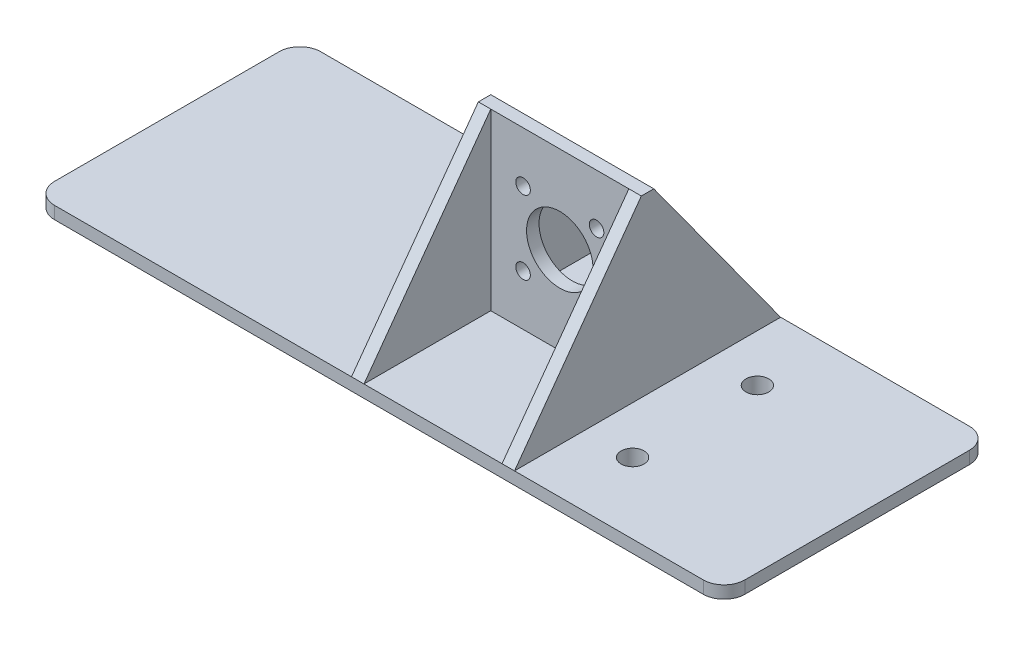
ISO-10303-21;
HEADER;
FILE_DESCRIPTION(('STEP AP214'),'2;1');
FILE_NAME('part.step','',(''),(''),'','','');
FILE_SCHEMA(('AUTOMOTIVE_DESIGN { 1 0 10303 214 1 1 1 1 }'));
ENDSEC;
DATA;
#1=APPLICATION_CONTEXT('core data for automotive mechanical design processes');
#2=APPLICATION_PROTOCOL_DEFINITION('international standard','automotive_design',2000,#1);
#3=PRODUCT_CONTEXT('',#1,'mechanical');
#4=PRODUCT('Part','Part','',(#3));
#5=PRODUCT_RELATED_PRODUCT_CATEGORY('part','',(#4));
#6=PRODUCT_DEFINITION_FORMATION('','',#4);
#7=PRODUCT_DEFINITION_CONTEXT('part definition',#1,'design');
#8=PRODUCT_DEFINITION('design','',#6,#7);
#9=PRODUCT_DEFINITION_SHAPE('','',#8);
#10=(LENGTH_UNIT() NAMED_UNIT(*) SI_UNIT(.MILLI.,.METRE.));
#11=(NAMED_UNIT(*) PLANE_ANGLE_UNIT() SI_UNIT($,.RADIAN.));
#12=(NAMED_UNIT(*) SI_UNIT($,.STERADIAN.) SOLID_ANGLE_UNIT());
#13=UNCERTAINTY_MEASURE_WITH_UNIT(LENGTH_MEASURE(1.E-05),#10,'distance_accuracy_value','');
#14=(GEOMETRIC_REPRESENTATION_CONTEXT(3) GLOBAL_UNCERTAINTY_ASSIGNED_CONTEXT((#13)) GLOBAL_UNIT_ASSIGNED_CONTEXT((#10,
#11,#12)) REPRESENTATION_CONTEXT('',''));
#15=CARTESIAN_POINT('',(0.,0.,0.));
#16=DIRECTION('',(0.,0.,1.));
#17=DIRECTION('',(1.,0.,0.));
#18=AXIS2_PLACEMENT_3D('',#15,#16,#17);
#19=CARTESIAN_POINT('',(78.,0.,-27.));
#20=DIRECTION('',(0.,-1.,0.));
#21=DIRECTION('',(0.,0.,-1.));
#22=AXIS2_PLACEMENT_3D('',#19,#20,#21);
#23=PLANE('',#22);
#24=CARTESIAN_POINT('',(44.,0.,-15.));
#25=DIRECTION('',(0.,-1.,0.));
#26=DIRECTION('',(0.,0.,-1.));
#27=AXIS2_PLACEMENT_3D('',#24,#25,#26);
#28=CIRCLE('',#27,4.75);
#29=CARTESIAN_POINT('',(44.,0.,-19.75));
#30=VERTEX_POINT('',#29);
#31=EDGE_CURVE('E734',#30,#30,#28,.T.);
#32=ORIENTED_EDGE('',*,*,#31,.F.);
#33=EDGE_LOOP('',(#32));
#34=FACE_BOUND('',#33,.T.);
#35=CARTESIAN_POINT('',(78.,0.,-27.));
#36=DIRECTION('',(0.,1.,0.));
#37=DIRECTION('',(0.,0.,-1.));
#38=AXIS2_PLACEMENT_3D('',#35,#36,#37);
#39=CIRCLE('',#38,5.);
#40=CARTESIAN_POINT('',(83.,0.,-27.));
#41=VERTEX_POINT('',#40);
#42=CARTESIAN_POINT('',(78.,0.,-32.));
#43=VERTEX_POINT('',#42);
#44=EDGE_CURVE('E226',#41,#43,#39,.T.);
#45=ORIENTED_EDGE('',*,*,#44,.F.);
#46=DIRECTION('',(0.,0.,-1.));
#47=VECTOR('',#46,1.);
#48=CARTESIAN_POINT('',(83.,0.,-27.));
#49=LINE('',#48,#47);
#50=CARTESIAN_POINT('',(83.,0.,27.));
#51=VERTEX_POINT('',#50);
#52=EDGE_CURVE('E205',#51,#41,#49,.T.);
#53=ORIENTED_EDGE('',*,*,#52,.F.);
#54=CARTESIAN_POINT('',(78.,0.,27.));
#55=DIRECTION('',(0.,1.,0.));
#56=DIRECTION('',(0.,0.,-1.));
#57=AXIS2_PLACEMENT_3D('',#54,#55,#56);
#58=CIRCLE('',#57,5.);
#59=CARTESIAN_POINT('',(78.,0.,32.));
#60=VERTEX_POINT('',#59);
#61=EDGE_CURVE('E240',#60,#51,#58,.T.);
#62=ORIENTED_EDGE('',*,*,#61,.F.);
#63=DIRECTION('',(1.,0.,0.));
#64=VECTOR('',#63,1.);
#65=CARTESIAN_POINT('',(78.,0.,32.));
#66=LINE('',#65,#64);
#67=CARTESIAN_POINT('',(-78.,0.,32.));
#68=VERTEX_POINT('',#67);
#69=EDGE_CURVE('E238',#68,#60,#66,.T.);
#70=ORIENTED_EDGE('',*,*,#69,.F.);
#71=CARTESIAN_POINT('',(-78.,0.,27.));
#72=DIRECTION('',(0.,1.,0.));
#73=DIRECTION('',(0.,0.,-1.));
#74=AXIS2_PLACEMENT_3D('',#71,#72,#73);
#75=CIRCLE('',#74,5.);
#76=CARTESIAN_POINT('',(-83.,0.,27.));
#77=VERTEX_POINT('',#76);
#78=EDGE_CURVE('E236',#77,#68,#75,.T.);
#79=ORIENTED_EDGE('',*,*,#78,.F.);
#80=DIRECTION('',(0.,0.,1.));
#81=VECTOR('',#80,1.);
#82=CARTESIAN_POINT('',(-83.,0.,-27.));
#83=LINE('',#82,#81);
#84=CARTESIAN_POINT('',(-83.,0.,-27.));
#85=VERTEX_POINT('',#84);
#86=EDGE_CURVE('E234',#85,#77,#83,.T.);
#87=ORIENTED_EDGE('',*,*,#86,.F.);
#88=CARTESIAN_POINT('',(-78.,0.,-27.));
#89=DIRECTION('',(0.,1.,0.));
#90=DIRECTION('',(0.,0.,1.));
#91=AXIS2_PLACEMENT_3D('',#88,#89,#90);
#92=CIRCLE('',#91,5.);
#93=CARTESIAN_POINT('',(-78.,0.,-32.));
#94=VERTEX_POINT('',#93);
#95=EDGE_CURVE('E232',#94,#85,#92,.T.);
#96=ORIENTED_EDGE('',*,*,#95,.F.);
#97=DIRECTION('',(-1.,0.,0.));
#98=VECTOR('',#97,1.);
#99=CARTESIAN_POINT('',(78.,0.,-32.));
#100=LINE('',#99,#98);
#101=EDGE_CURVE('E229',#43,#94,#100,.T.);
#102=ORIENTED_EDGE('',*,*,#101,.F.);
#103=EDGE_LOOP('',(#45,#53,#62,#70,#79,#87,#96,#102));
#104=FACE_BOUND('',#103,.T.);
#105=CARTESIAN_POINT('',(-18.,0.,0.));
#106=DIRECTION('',(0.,-1.,0.));
#107=DIRECTION('',(0.,0.,-1.));
#108=AXIS2_PLACEMENT_3D('',#105,#106,#107);
#109=CIRCLE('',#108,4.75);
#110=CARTESIAN_POINT('',(-18.,0.,-4.75));
#111=VERTEX_POINT('',#110);
#112=EDGE_CURVE('E723',#111,#111,#109,.T.);
#113=ORIENTED_EDGE('',*,*,#112,.F.);
#114=EDGE_LOOP('',(#113));
#115=FACE_BOUND('',#114,.T.);
#116=CARTESIAN_POINT('',(44.,0.,15.));
#117=DIRECTION('',(0.,-1.,0.));
#118=DIRECTION('',(0.,0.,-1.));
#119=AXIS2_PLACEMENT_3D('',#116,#117,#118);
#120=CIRCLE('',#119,4.75);
#121=CARTESIAN_POINT('',(44.,0.,10.25));
#122=VERTEX_POINT('',#121);
#123=EDGE_CURVE('E743',#122,#122,#120,.T.);
#124=ORIENTED_EDGE('',*,*,#123,.F.);
#125=EDGE_LOOP('',(#124));
#126=FACE_BOUND('',#125,.T.);
#127=ADVANCED_FACE('F37',(#34,#104,#115,#126),#23,.T.);
#128=CARTESIAN_POINT('',(78.,3.,-27.));
#129=DIRECTION('',(0.,-1.,0.));
#130=DIRECTION('',(0.,0.,-1.));
#131=AXIS2_PLACEMENT_3D('',#128,#129,#130);
#132=PLANE('',#131);
#133=CARTESIAN_POINT('',(-18.,3.,0.));
#134=DIRECTION('',(0.,1.,0.));
#135=DIRECTION('',(0.,0.,1.));
#136=AXIS2_PLACEMENT_3D('',#133,#134,#135);
#137=CIRCLE('',#136,2.75);
#138=CARTESIAN_POINT('',(-18.,3.,2.75));
#139=VERTEX_POINT('',#138);
#140=EDGE_CURVE('E302',#139,#139,#137,.T.);
#141=ORIENTED_EDGE('',*,*,#140,.F.);
#142=EDGE_LOOP('',(#141));
#143=FACE_BOUND('',#142,.T.);
#144=DIRECTION('',(1.,0.,0.));
#145=VECTOR('',#144,1.);
#146=CARTESIAN_POINT('',(78.,3.,32.));
#147=LINE('',#146,#145);
#148=CARTESIAN_POINT('',(-78.,3.,32.));
#149=VERTEX_POINT('',#148);
#150=CARTESIAN_POINT('',(-6.59999999999999,3.,32.));
#151=VERTEX_POINT('',#150);
#152=EDGE_CURVE('E191',#149,#151,#147,.T.);
#153=ORIENTED_EDGE('',*,*,#152,.T.);
#154=DIRECTION('',(0.,0.,1.));
#155=VECTOR('',#154,1.);
#156=CARTESIAN_POINT('',(-6.59999999999999,3.,-1.49999999999999));
#157=LINE('',#156,#155);
#158=CARTESIAN_POINT('',(-6.59999999999999,3.,-32.));
#159=VERTEX_POINT('',#158);
#160=EDGE_CURVE('E180',#159,#151,#157,.T.);
#161=ORIENTED_EDGE('',*,*,#160,.F.);
#162=DIRECTION('',(-1.,0.,0.));
#163=VECTOR('',#162,1.);
#164=CARTESIAN_POINT('',(78.,3.,-32.));
#165=LINE('',#164,#163);
#166=CARTESIAN_POINT('',(-78.,3.,-32.));
#167=VERTEX_POINT('',#166);
#168=EDGE_CURVE('E188',#159,#167,#165,.T.);
#169=ORIENTED_EDGE('',*,*,#168,.T.);
#170=CARTESIAN_POINT('',(-78.,3.,-27.));
#171=DIRECTION('',(0.,1.,0.));
#172=DIRECTION('',(0.,0.,1.));
#173=AXIS2_PLACEMENT_3D('',#170,#171,#172);
#174=CIRCLE('',#173,5.);
#175=CARTESIAN_POINT('',(-83.,3.,-27.));
#176=VERTEX_POINT('',#175);
#177=EDGE_CURVE('E209',#167,#176,#174,.T.);
#178=ORIENTED_EDGE('',*,*,#177,.T.);
#179=DIRECTION('',(0.,0.,1.));
#180=VECTOR('',#179,1.);
#181=CARTESIAN_POINT('',(-83.,3.,-27.));
#182=LINE('',#181,#180);
#183=CARTESIAN_POINT('',(-83.,3.,27.));
#184=VERTEX_POINT('',#183);
#185=EDGE_CURVE('E212',#176,#184,#182,.T.);
#186=ORIENTED_EDGE('',*,*,#185,.T.);
#187=CARTESIAN_POINT('',(-78.,3.,27.));
#188=DIRECTION('',(0.,1.,0.));
#189=DIRECTION('',(0.,0.,-1.));
#190=AXIS2_PLACEMENT_3D('',#187,#188,#189);
#191=CIRCLE('',#190,5.);
#192=EDGE_CURVE('E214',#184,#149,#191,.T.);
#193=ORIENTED_EDGE('',*,*,#192,.T.);
#194=EDGE_LOOP('',(#153,#161,#169,#178,#186,#193));
#195=FACE_BOUND('',#194,.T.);
#196=ADVANCED_FACE('F187',(#143,#195),#132,.F.);
#197=CARTESIAN_POINT('',(29.6,3.,-32.));
#198=VERTEX_POINT('',#197);
#199=CARTESIAN_POINT('',(-3.59999999999999,3.,-32.));
#200=VERTEX_POINT('',#199);
#201=EDGE_CURVE('E199',#198,#200,#165,.T.);
#202=ORIENTED_EDGE('',*,*,#201,.T.);
#203=DIRECTION('',(0.,0.,-1.));
#204=VECTOR('',#203,1.);
#205=CARTESIAN_POINT('',(-3.59999999999999,3.,32.));
#206=LINE('',#205,#204);
#207=CARTESIAN_POINT('',(-3.59999999999999,3.,-1.49999999999999));
#208=VERTEX_POINT('',#207);
#209=EDGE_CURVE('E704',#208,#200,#206,.T.);
#210=ORIENTED_EDGE('',*,*,#209,.F.);
#211=DIRECTION('',(-1.,0.,0.));
#212=VECTOR('',#211,1.);
#213=CARTESIAN_POINT('',(-6.59999999999999,3.,-1.49999999999999));
#214=LINE('',#213,#212);
#215=CARTESIAN_POINT('',(29.6,3.,-1.50000000000001));
#216=VERTEX_POINT('',#215);
#217=EDGE_CURVE('E297',#216,#208,#214,.T.);
#218=ORIENTED_EDGE('',*,*,#217,.F.);
#219=DIRECTION('',(0.,0.,-1.));
#220=VECTOR('',#219,1.);
#221=CARTESIAN_POINT('',(29.6,3.,32.));
#222=LINE('',#221,#220);
#223=EDGE_CURVE('E52',#216,#198,#222,.T.);
#224=ORIENTED_EDGE('',*,*,#223,.T.);
#225=EDGE_LOOP('',(#202,#210,#218,#224));
#226=FACE_BOUND('',#225,.T.);
#227=ADVANCED_FACE('F322',(#226),#132,.F.);
#228=CARTESIAN_POINT('',(44.,3.,15.));
#229=DIRECTION('',(0.,1.,0.));
#230=DIRECTION('',(0.,0.,1.));
#231=AXIS2_PLACEMENT_3D('',#228,#229,#230);
#232=CIRCLE('',#231,2.75);
#233=CARTESIAN_POINT('',(44.,3.,17.75));
#234=VERTEX_POINT('',#233);
#235=EDGE_CURVE('E230',#234,#234,#232,.T.);
#236=ORIENTED_EDGE('',*,*,#235,.F.);
#237=EDGE_LOOP('',(#236));
#238=FACE_BOUND('',#237,.T.);
#239=CARTESIAN_POINT('',(44.,3.,-15.));
#240=DIRECTION('',(0.,1.,0.));
#241=DIRECTION('',(0.,0.,-1.));
#242=AXIS2_PLACEMENT_3D('',#239,#240,#241);
#243=CIRCLE('',#242,2.75);
#244=CARTESIAN_POINT('',(44.,3.,-17.75));
#245=VERTEX_POINT('',#244);
#246=EDGE_CURVE('E312',#245,#245,#243,.T.);
#247=ORIENTED_EDGE('',*,*,#246,.F.);
#248=EDGE_LOOP('',(#247));
#249=FACE_BOUND('',#248,.T.);
#250=CARTESIAN_POINT('',(78.,3.,-32.));
#251=VERTEX_POINT('',#250);
#252=CARTESIAN_POINT('',(32.6,3.,-32.));
#253=VERTEX_POINT('',#252);
#254=EDGE_CURVE('E202',#251,#253,#165,.T.);
#255=ORIENTED_EDGE('',*,*,#254,.T.);
#256=DIRECTION('',(0.,0.,-1.));
#257=VECTOR('',#256,1.);
#258=CARTESIAN_POINT('',(32.6,3.,-1.50000000000001));
#259=LINE('',#258,#257);
#260=CARTESIAN_POINT('',(32.6,3.,32.));
#261=VERTEX_POINT('',#260);
#262=EDGE_CURVE('E305',#261,#253,#259,.T.);
#263=ORIENTED_EDGE('',*,*,#262,.F.);
#264=CARTESIAN_POINT('',(78.,3.,32.));
#265=VERTEX_POINT('',#264);
#266=EDGE_CURVE('E218',#261,#265,#147,.T.);
#267=ORIENTED_EDGE('',*,*,#266,.T.);
#268=CARTESIAN_POINT('',(78.,3.,27.));
#269=DIRECTION('',(0.,1.,0.));
#270=DIRECTION('',(0.,0.,-1.));
#271=AXIS2_PLACEMENT_3D('',#268,#269,#270);
#272=CIRCLE('',#271,5.);
#273=CARTESIAN_POINT('',(83.,3.,27.));
#274=VERTEX_POINT('',#273);
#275=EDGE_CURVE('E220',#265,#274,#272,.T.);
#276=ORIENTED_EDGE('',*,*,#275,.T.);
#277=DIRECTION('',(0.,0.,-1.));
#278=VECTOR('',#277,1.);
#279=CARTESIAN_POINT('',(83.,3.,-27.));
#280=LINE('',#279,#278);
#281=CARTESIAN_POINT('',(83.,3.,-27.));
#282=VERTEX_POINT('',#281);
#283=EDGE_CURVE('E223',#274,#282,#280,.T.);
#284=ORIENTED_EDGE('',*,*,#283,.T.);
#285=CARTESIAN_POINT('',(78.,3.,-27.));
#286=DIRECTION('',(0.,1.,0.));
#287=DIRECTION('',(0.,0.,-1.));
#288=AXIS2_PLACEMENT_3D('',#285,#286,#287);
#289=CIRCLE('',#288,5.);
#290=EDGE_CURVE('E200',#282,#251,#289,.T.);
#291=ORIENTED_EDGE('',*,*,#290,.T.);
#292=EDGE_LOOP('',(#255,#263,#267,#276,#284,#291));
#293=FACE_BOUND('',#292,.T.);
#294=ADVANCED_FACE('F329',(#238,#249,#293),#132,.F.);
#295=DIRECTION('',(1.,0.,0.));
#296=VECTOR('',#295,1.);
#297=CARTESIAN_POINT('',(-6.59999999999999,3.,1.49999999999999));
#298=LINE('',#297,#296);
#299=CARTESIAN_POINT('',(-3.59999999999999,3.,1.49999999999999));
#300=VERTEX_POINT('',#299);
#301=CARTESIAN_POINT('',(29.6,3.,1.49999999999999));
#302=VERTEX_POINT('',#301);
#303=EDGE_CURVE('E192',#300,#302,#298,.T.);
#304=ORIENTED_EDGE('',*,*,#303,.F.);
#305=CARTESIAN_POINT('',(-3.59999999999999,3.,32.));
#306=VERTEX_POINT('',#305);
#307=EDGE_CURVE('E284',#306,#300,#206,.T.);
#308=ORIENTED_EDGE('',*,*,#307,.F.);
#309=CARTESIAN_POINT('',(29.6,3.,32.));
#310=VERTEX_POINT('',#309);
#311=EDGE_CURVE('E221',#306,#310,#147,.T.);
#312=ORIENTED_EDGE('',*,*,#311,.T.);
#313=EDGE_CURVE('E348',#310,#302,#222,.T.);
#314=ORIENTED_EDGE('',*,*,#313,.T.);
#315=EDGE_LOOP('',(#304,#308,#312,#314));
#316=FACE_BOUND('',#315,.T.);
#317=ADVANCED_FACE('F324',(#316),#132,.F.);
#318=CARTESIAN_POINT('',(78.,3.,-27.));
#319=DIRECTION('',(0.,-1.,0.));
#320=DIRECTION('',(0.,0.,-1.));
#321=AXIS2_PLACEMENT_3D('',#318,#319,#320);
#322=CYLINDRICAL_SURFACE('',#321,5.);
#323=ORIENTED_EDGE('',*,*,#44,.T.);
#324=DIRECTION('',(0.,-1.,0.));
#325=VECTOR('',#324,1.);
#326=CARTESIAN_POINT('',(78.,3.,-32.));
#327=LINE('',#326,#325);
#328=EDGE_CURVE('E261',#251,#43,#327,.T.);
#329=ORIENTED_EDGE('',*,*,#328,.F.);
#330=ORIENTED_EDGE('',*,*,#290,.F.);
#331=DIRECTION('',(0.,-1.,0.));
#332=VECTOR('',#331,1.);
#333=CARTESIAN_POINT('',(83.,3.,-27.));
#334=LINE('',#333,#332);
#335=EDGE_CURVE('E225',#282,#41,#334,.T.);
#336=ORIENTED_EDGE('',*,*,#335,.T.);
#337=EDGE_LOOP('',(#323,#329,#330,#336));
#338=FACE_BOUND('',#337,.T.);
#339=ADVANCED_FACE('F39',(#338),#322,.T.);
#340=CARTESIAN_POINT('',(78.,3.,-32.));
#341=DIRECTION('',(0.,0.,1.));
#342=DIRECTION('',(1.,0.,0.));
#343=AXIS2_PLACEMENT_3D('',#340,#341,#342);
#344=PLANE('',#343);
#345=ORIENTED_EDGE('',*,*,#168,.F.);
#346=DIRECTION('',(-1.,0.,0.));
#347=VECTOR('',#346,1.);
#348=CARTESIAN_POINT('',(83.,3.,-32.));
#349=LINE('',#348,#347);
#350=EDGE_CURVE('E162',#200,#159,#349,.T.);
#351=ORIENTED_EDGE('',*,*,#350,.F.);
#352=ORIENTED_EDGE('',*,*,#201,.F.);
#353=EDGE_CURVE('E172',#253,#198,#349,.T.);
#354=ORIENTED_EDGE('',*,*,#353,.F.);
#355=ORIENTED_EDGE('',*,*,#254,.F.);
#356=ORIENTED_EDGE('',*,*,#328,.T.);
#357=ORIENTED_EDGE('',*,*,#101,.T.);
#358=DIRECTION('',(0.,-1.,0.));
#359=VECTOR('',#358,1.);
#360=CARTESIAN_POINT('',(-78.,3.,-32.));
#361=LINE('',#360,#359);
#362=EDGE_CURVE('E197',#167,#94,#361,.T.);
#363=ORIENTED_EDGE('',*,*,#362,.F.);
#364=EDGE_LOOP('',(#345,#351,#352,#354,#355,#356,#357,#363));
#365=FACE_BOUND('',#364,.T.);
#366=ADVANCED_FACE('F195',(#365),#344,.F.);
#367=CARTESIAN_POINT('',(-78.,3.,-27.));
#368=DIRECTION('',(0.,-1.,0.));
#369=DIRECTION('',(0.,0.,-1.));
#370=AXIS2_PLACEMENT_3D('',#367,#368,#369);
#371=CYLINDRICAL_SURFACE('',#370,5.);
#372=ORIENTED_EDGE('',*,*,#95,.T.);
#373=DIRECTION('',(0.,-1.,0.));
#374=VECTOR('',#373,1.);
#375=CARTESIAN_POINT('',(-83.,3.,-27.));
#376=LINE('',#375,#374);
#377=EDGE_CURVE('E257',#176,#85,#376,.T.);
#378=ORIENTED_EDGE('',*,*,#377,.F.);
#379=ORIENTED_EDGE('',*,*,#177,.F.);
#380=ORIENTED_EDGE('',*,*,#362,.T.);
#381=EDGE_LOOP('',(#372,#378,#379,#380));
#382=FACE_BOUND('',#381,.T.);
#383=ADVANCED_FACE('F455',(#382),#371,.T.);
#384=CARTESIAN_POINT('',(-83.,3.,-27.));
#385=DIRECTION('',(1.,0.,0.));
#386=DIRECTION('',(0.,0.,-1.));
#387=AXIS2_PLACEMENT_3D('',#384,#385,#386);
#388=PLANE('',#387);
#389=ORIENTED_EDGE('',*,*,#86,.T.);
#390=DIRECTION('',(0.,-1.,0.));
#391=VECTOR('',#390,1.);
#392=CARTESIAN_POINT('',(-83.,3.,27.));
#393=LINE('',#392,#391);
#394=EDGE_CURVE('E254',#184,#77,#393,.T.);
#395=ORIENTED_EDGE('',*,*,#394,.F.);
#396=ORIENTED_EDGE('',*,*,#185,.F.);
#397=ORIENTED_EDGE('',*,*,#377,.T.);
#398=EDGE_LOOP('',(#389,#395,#396,#397));
#399=FACE_BOUND('',#398,.T.);
#400=ADVANCED_FACE('F451',(#399),#388,.F.);
#401=CARTESIAN_POINT('',(-78.,3.,27.));
#402=DIRECTION('',(0.,-1.,0.));
#403=DIRECTION('',(0.,0.,-1.));
#404=AXIS2_PLACEMENT_3D('',#401,#402,#403);
#405=CYLINDRICAL_SURFACE('',#404,5.);
#406=ORIENTED_EDGE('',*,*,#78,.T.);
#407=DIRECTION('',(0.,-1.,0.));
#408=VECTOR('',#407,1.);
#409=CARTESIAN_POINT('',(-78.,3.,32.));
#410=LINE('',#409,#408);
#411=EDGE_CURVE('E251',#149,#68,#410,.T.);
#412=ORIENTED_EDGE('',*,*,#411,.F.);
#413=ORIENTED_EDGE('',*,*,#192,.F.);
#414=ORIENTED_EDGE('',*,*,#394,.T.);
#415=EDGE_LOOP('',(#406,#412,#413,#414));
#416=FACE_BOUND('',#415,.T.);
#417=ADVANCED_FACE('F447',(#416),#405,.T.);
#418=CARTESIAN_POINT('',(78.,3.,32.));
#419=DIRECTION('',(0.,0.,-1.));
#420=DIRECTION('',(-1.,0.,0.));
#421=AXIS2_PLACEMENT_3D('',#418,#419,#420);
#422=PLANE('',#421);
#423=ORIENTED_EDGE('',*,*,#266,.F.);
#424=DIRECTION('',(-1.,0.,0.));
#425=VECTOR('',#424,1.);
#426=CARTESIAN_POINT('',(83.,3.,32.));
#427=LINE('',#426,#425);
#428=EDGE_CURVE('E279',#261,#310,#427,.T.);
#429=ORIENTED_EDGE('',*,*,#428,.T.);
#430=ORIENTED_EDGE('',*,*,#311,.F.);
#431=EDGE_CURVE('E269',#306,#151,#427,.T.);
#432=ORIENTED_EDGE('',*,*,#431,.T.);
#433=ORIENTED_EDGE('',*,*,#152,.F.);
#434=ORIENTED_EDGE('',*,*,#411,.T.);
#435=ORIENTED_EDGE('',*,*,#69,.T.);
#436=DIRECTION('',(0.,-1.,0.));
#437=VECTOR('',#436,1.);
#438=CARTESIAN_POINT('',(78.,3.,32.));
#439=LINE('',#438,#437);
#440=EDGE_CURVE('E248',#265,#60,#439,.T.);
#441=ORIENTED_EDGE('',*,*,#440,.F.);
#442=EDGE_LOOP('',(#423,#429,#430,#432,#433,#434,#435,#441));
#443=FACE_BOUND('',#442,.T.);
#444=ADVANCED_FACE('F442',(#443),#422,.F.);
#445=CARTESIAN_POINT('',(78.,3.,27.));
#446=DIRECTION('',(0.,-1.,0.));
#447=DIRECTION('',(0.,0.,-1.));
#448=AXIS2_PLACEMENT_3D('',#445,#446,#447);
#449=CYLINDRICAL_SURFACE('',#448,5.);
#450=ORIENTED_EDGE('',*,*,#61,.T.);
#451=DIRECTION('',(0.,-1.,0.));
#452=VECTOR('',#451,1.);
#453=CARTESIAN_POINT('',(83.,3.,27.));
#454=LINE('',#453,#452);
#455=EDGE_CURVE('E245',#274,#51,#454,.T.);
#456=ORIENTED_EDGE('',*,*,#455,.F.);
#457=ORIENTED_EDGE('',*,*,#275,.F.);
#458=ORIENTED_EDGE('',*,*,#440,.T.);
#459=EDGE_LOOP('',(#450,#456,#457,#458));
#460=FACE_BOUND('',#459,.T.);
#461=ADVANCED_FACE('F435',(#460),#449,.T.);
#462=CARTESIAN_POINT('',(83.,3.,-27.));
#463=DIRECTION('',(-1.,0.,0.));
#464=DIRECTION('',(0.,0.,1.));
#465=AXIS2_PLACEMENT_3D('',#462,#463,#464);
#466=PLANE('',#465);
#467=ORIENTED_EDGE('',*,*,#52,.T.);
#468=ORIENTED_EDGE('',*,*,#335,.F.);
#469=ORIENTED_EDGE('',*,*,#283,.F.);
#470=ORIENTED_EDGE('',*,*,#455,.T.);
#471=EDGE_LOOP('',(#467,#468,#469,#470));
#472=FACE_BOUND('',#471,.T.);
#473=ADVANCED_FACE('F430',(#472),#466,.F.);
#474=CARTESIAN_POINT('',(-18.,0.,0.));
#475=DIRECTION('',(0.,1.,0.));
#476=DIRECTION('',(0.,0.,1.));
#477=AXIS2_PLACEMENT_3D('',#474,#475,#476);
#478=CYLINDRICAL_SURFACE('',#477,2.75);
#479=ORIENTED_EDGE('',*,*,#140,.T.);
#480=EDGE_LOOP('',(#479));
#481=FACE_BOUND('',#480,.T.);
#482=CARTESIAN_POINT('',(-18.,-4.5,0.));
#483=DIRECTION('',(0.,-1.,0.));
#484=DIRECTION('',(0.,0.,-1.));
#485=AXIS2_PLACEMENT_3D('',#482,#483,#484);
#486=CIRCLE('',#485,2.75);
#487=CARTESIAN_POINT('',(-18.,-4.5,-2.75));
#488=VERTEX_POINT('',#487);
#489=EDGE_CURVE('E726',#488,#488,#486,.T.);
#490=ORIENTED_EDGE('',*,*,#489,.T.);
#491=EDGE_LOOP('',(#490));
#492=FACE_BOUND('',#491,.T.);
#493=ADVANCED_FACE('F318',(#481,#492),#478,.F.);
#494=CARTESIAN_POINT('',(44.,0.,-15.));
#495=DIRECTION('',(0.,1.,0.));
#496=DIRECTION('',(0.,0.,1.));
#497=AXIS2_PLACEMENT_3D('',#494,#495,#496);
#498=CYLINDRICAL_SURFACE('',#497,2.75);
#499=ORIENTED_EDGE('',*,*,#246,.T.);
#500=EDGE_LOOP('',(#499));
#501=FACE_BOUND('',#500,.T.);
#502=CARTESIAN_POINT('',(44.,-4.5,-15.));
#503=DIRECTION('',(0.,-1.,0.));
#504=DIRECTION('',(0.,0.,-1.));
#505=AXIS2_PLACEMENT_3D('',#502,#503,#504);
#506=CIRCLE('',#505,2.75);
#507=CARTESIAN_POINT('',(44.,-4.5,-17.75));
#508=VERTEX_POINT('',#507);
#509=EDGE_CURVE('E731',#508,#508,#506,.T.);
#510=ORIENTED_EDGE('',*,*,#509,.T.);
#511=EDGE_LOOP('',(#510));
#512=FACE_BOUND('',#511,.T.);
#513=ADVANCED_FACE('F425',(#501,#512),#498,.F.);
#514=CARTESIAN_POINT('',(44.,0.,15.));
#515=DIRECTION('',(0.,1.,0.));
#516=DIRECTION('',(0.,0.,1.));
#517=AXIS2_PLACEMENT_3D('',#514,#515,#516);
#518=CYLINDRICAL_SURFACE('',#517,2.75);
#519=ORIENTED_EDGE('',*,*,#235,.T.);
#520=EDGE_LOOP('',(#519));
#521=FACE_BOUND('',#520,.T.);
#522=CARTESIAN_POINT('',(44.,-4.5,15.));
#523=DIRECTION('',(0.,-1.,0.));
#524=DIRECTION('',(0.,0.,-1.));
#525=AXIS2_PLACEMENT_3D('',#522,#523,#524);
#526=CIRCLE('',#525,2.75);
#527=CARTESIAN_POINT('',(44.,-4.5,12.25));
#528=VERTEX_POINT('',#527);
#529=EDGE_CURVE('E738',#528,#528,#526,.T.);
#530=ORIENTED_EDGE('',*,*,#529,.T.);
#531=EDGE_LOOP('',(#530));
#532=FACE_BOUND('',#531,.T.);
#533=ADVANCED_FACE('F422',(#521,#532),#518,.F.);
#534=CARTESIAN_POINT('',(-6.59999999999999,45.,-1.49999999999999));
#535=DIRECTION('',(1.,0.,0.));
#536=DIRECTION('',(0.,0.,-1.));
#537=AXIS2_PLACEMENT_3D('',#534,#535,#536);
#538=PLANE('',#537);
#539=DIRECTION('',(0.,0.,1.));
#540=VECTOR('',#539,1.);
#541=CARTESIAN_POINT('',(-6.59999999999999,45.,-1.49999999999999));
#542=LINE('',#541,#540);
#543=CARTESIAN_POINT('',(-6.59999999999999,45.,-1.5));
#544=VERTEX_POINT('',#543);
#545=CARTESIAN_POINT('',(-6.59999999999999,45.,1.5));
#546=VERTEX_POINT('',#545);
#547=EDGE_CURVE('E183',#544,#546,#542,.T.);
#548=ORIENTED_EDGE('',*,*,#547,.F.);
#549=DIRECTION('',(0.,0.809152433574184,0.587598791047919));
#550=VECTOR('',#549,1.);
#551=CARTESIAN_POINT('',(-6.59999999999999,45.,-1.5));
#552=LINE('',#551,#550);
#553=EDGE_CURVE('E165',#159,#544,#552,.T.);
#554=ORIENTED_EDGE('',*,*,#553,.F.);
#555=ORIENTED_EDGE('',*,*,#160,.T.);
#556=DIRECTION('',(0.,-0.809152433574184,0.587598791047919));
#557=VECTOR('',#556,1.);
#558=CARTESIAN_POINT('',(-6.59999999999999,45.,1.5));
#559=LINE('',#558,#557);
#560=EDGE_CURVE('E184',#546,#151,#559,.T.);
#561=ORIENTED_EDGE('',*,*,#560,.F.);
#562=EDGE_LOOP('',(#548,#554,#555,#561));
#563=FACE_BOUND('',#562,.T.);
#564=ADVANCED_FACE('F178',(#563),#538,.F.);
#565=CARTESIAN_POINT('',(-6.59999999999999,45.,1.49999999999999));
#566=DIRECTION('',(0.,0.,-1.));
#567=DIRECTION('',(-1.,0.,0.));
#568=AXIS2_PLACEMENT_3D('',#565,#566,#567);
#569=PLANE('',#568);
#570=CARTESIAN_POINT('',(4.16116523516813,32.8388347648318,1.49999999999999));
#571=DIRECTION('',(0.,0.,-1.));
#572=DIRECTION('',(-1.,0.,0.));
#573=AXIS2_PLACEMENT_3D('',#570,#571,#572);
#574=CIRCLE('',#573,1.75);
#575=CARTESIAN_POINT('',(2.41116523516813,32.8388347648318,1.49999999999999));
#576=VERTEX_POINT('',#575);
#577=EDGE_CURVE('E193',#576,#576,#574,.T.);
#578=ORIENTED_EDGE('',*,*,#577,.T.);
#579=EDGE_LOOP('',(#578));
#580=FACE_BOUND('',#579,.T.);
#581=CARTESIAN_POINT('',(21.8388347648319,32.8388347648318,1.49999999999999));
#582=DIRECTION('',(0.,0.,-1.));
#583=DIRECTION('',(-1.,0.,0.));
#584=AXIS2_PLACEMENT_3D('',#581,#582,#583);
#585=CIRCLE('',#584,1.75);
#586=CARTESIAN_POINT('',(20.0888347648319,32.8388347648318,1.49999999999999));
#587=VERTEX_POINT('',#586);
#588=EDGE_CURVE('E381',#587,#587,#585,.T.);
#589=ORIENTED_EDGE('',*,*,#588,.T.);
#590=EDGE_LOOP('',(#589));
#591=FACE_BOUND('',#590,.T.);
#592=CARTESIAN_POINT('',(4.16116523516813,15.1611652351682,1.49999999999999));
#593=DIRECTION('',(0.,0.,-1.));
#594=DIRECTION('',(-1.,0.,0.));
#595=AXIS2_PLACEMENT_3D('',#592,#593,#594);
#596=CIRCLE('',#595,1.75);
#597=CARTESIAN_POINT('',(2.41116523516813,15.1611652351682,1.49999999999999));
#598=VERTEX_POINT('',#597);
#599=EDGE_CURVE('E378',#598,#598,#596,.T.);
#600=ORIENTED_EDGE('',*,*,#599,.T.);
#601=EDGE_LOOP('',(#600));
#602=FACE_BOUND('',#601,.T.);
#603=CARTESIAN_POINT('',(21.8388347648319,15.1611652351682,1.49999999999999));
#604=DIRECTION('',(0.,0.,-1.));
#605=DIRECTION('',(-1.,0.,0.));
#606=AXIS2_PLACEMENT_3D('',#603,#604,#605);
#607=CIRCLE('',#606,1.75);
#608=CARTESIAN_POINT('',(20.0888347648319,15.1611652351682,1.49999999999999));
#609=VERTEX_POINT('',#608);
#610=EDGE_CURVE('E375',#609,#609,#607,.T.);
#611=ORIENTED_EDGE('',*,*,#610,.T.);
#612=EDGE_LOOP('',(#611));
#613=FACE_BOUND('',#612,.T.);
#614=CARTESIAN_POINT('',(13.,24.,1.49999999999999));
#615=DIRECTION('',(0.,0.,-1.));
#616=DIRECTION('',(-1.,0.,0.));
#617=AXIS2_PLACEMENT_3D('',#614,#615,#616);
#618=CIRCLE('',#617,8.00000000000001);
#619=CARTESIAN_POINT('',(4.99999999999998,24.,1.49999999999999));
#620=VERTEX_POINT('',#619);
#621=EDGE_CURVE('E372',#620,#620,#618,.T.);
#622=ORIENTED_EDGE('',*,*,#621,.T.);
#623=EDGE_LOOP('',(#622));
#624=FACE_BOUND('',#623,.T.);
#625=DIRECTION('',(1.,0.,0.));
#626=VECTOR('',#625,1.);
#627=CARTESIAN_POINT('',(-6.59999999999999,45.,1.49999999999999));
#628=LINE('',#627,#626);
#629=CARTESIAN_POINT('',(-3.59999999999999,45.,1.5));
#630=VERTEX_POINT('',#629);
#631=CARTESIAN_POINT('',(29.6,45.,1.49999999999999));
#632=VERTEX_POINT('',#631);
#633=EDGE_CURVE('E277',#630,#632,#628,.T.);
#634=ORIENTED_EDGE('',*,*,#633,.F.);
#635=DIRECTION('',(0.,-1.,0.));
#636=VECTOR('',#635,1.);
#637=CARTESIAN_POINT('',(-3.59999999999999,45.,1.49999999999999));
#638=LINE('',#637,#636);
#639=EDGE_CURVE('E282',#630,#300,#638,.T.);
#640=ORIENTED_EDGE('',*,*,#639,.T.);
#641=ORIENTED_EDGE('',*,*,#303,.T.);
#642=DIRECTION('',(0.,1.,0.));
#643=VECTOR('',#642,1.);
#644=CARTESIAN_POINT('',(29.6,45.,1.49999999999999));
#645=LINE('',#644,#643);
#646=EDGE_CURVE('E291',#302,#632,#645,.T.);
#647=ORIENTED_EDGE('',*,*,#646,.T.);
#648=EDGE_LOOP('',(#634,#640,#641,#647));
#649=FACE_BOUND('',#648,.T.);
#650=ADVANCED_FACE('F289',(#580,#591,#602,#613,#624,#649),#569,.F.);
#651=CARTESIAN_POINT('',(32.6,45.,-1.50000000000001));
#652=DIRECTION('',(-1.,0.,0.));
#653=DIRECTION('',(0.,0.,1.));
#654=AXIS2_PLACEMENT_3D('',#651,#652,#653);
#655=PLANE('',#654);
#656=ORIENTED_EDGE('',*,*,#262,.T.);
#657=DIRECTION('',(0.,0.809152433574184,0.587598791047919));
#658=VECTOR('',#657,1.);
#659=CARTESIAN_POINT('',(32.6,45.,-1.5));
#660=LINE('',#659,#658);
#661=CARTESIAN_POINT('',(32.6,45.,-1.5));
#662=VERTEX_POINT('',#661);
#663=EDGE_CURVE('E705',#253,#662,#660,.T.);
#664=ORIENTED_EDGE('',*,*,#663,.T.);
#665=DIRECTION('',(0.,0.,-1.));
#666=VECTOR('',#665,1.);
#667=CARTESIAN_POINT('',(32.6,45.,-1.50000000000001));
#668=LINE('',#667,#666);
#669=CARTESIAN_POINT('',(32.6,45.,1.5));
#670=VERTEX_POINT('',#669);
#671=EDGE_CURVE('E292',#670,#662,#668,.T.);
#672=ORIENTED_EDGE('',*,*,#671,.F.);
#673=DIRECTION('',(0.,-0.809152433574184,0.587598791047919));
#674=VECTOR('',#673,1.);
#675=CARTESIAN_POINT('',(32.6,46.426370975225,0.464182982277067));
#676=LINE('',#675,#674);
#677=EDGE_CURVE('E713',#670,#261,#676,.T.);
#678=ORIENTED_EDGE('',*,*,#677,.T.);
#679=EDGE_LOOP('',(#656,#664,#672,#678));
#680=FACE_BOUND('',#679,.T.);
#681=ADVANCED_FACE('F413',(#680),#655,.F.);
#682=CARTESIAN_POINT('',(-6.59999999999999,45.,-1.49999999999999));
#683=DIRECTION('',(0.,0.,1.));
#684=DIRECTION('',(1.,0.,0.));
#685=AXIS2_PLACEMENT_3D('',#682,#683,#684);
#686=PLANE('',#685);
#687=CARTESIAN_POINT('',(4.16116523516813,32.8388347648318,-1.49999999999999));
#688=DIRECTION('',(0.,0.,-1.));
#689=DIRECTION('',(1.,0.,0.));
#690=AXIS2_PLACEMENT_3D('',#687,#688,#689);
#691=CIRCLE('',#690,1.75);
#692=CARTESIAN_POINT('',(5.91116523516813,32.8388347648318,-1.49999999999999));
#693=VERTEX_POINT('',#692);
#694=EDGE_CURVE('E352',#693,#693,#691,.T.);
#695=ORIENTED_EDGE('',*,*,#694,.F.);
#696=EDGE_LOOP('',(#695));
#697=FACE_BOUND('',#696,.T.);
#698=CARTESIAN_POINT('',(21.8388347648319,32.8388347648318,-1.49999999999999));
#699=DIRECTION('',(0.,0.,-1.));
#700=DIRECTION('',(-1.,0.,0.));
#701=AXIS2_PLACEMENT_3D('',#698,#699,#700);
#702=CIRCLE('',#701,1.75);
#703=CARTESIAN_POINT('',(20.0888347648319,32.8388347648318,-1.49999999999999));
#704=VERTEX_POINT('',#703);
#705=EDGE_CURVE('E356',#704,#704,#702,.T.);
#706=ORIENTED_EDGE('',*,*,#705,.F.);
#707=EDGE_LOOP('',(#706));
#708=FACE_BOUND('',#707,.T.);
#709=CARTESIAN_POINT('',(4.16116523516813,15.1611652351682,-1.49999999999999));
#710=DIRECTION('',(0.,0.,-1.));
#711=DIRECTION('',(-1.,0.,0.));
#712=AXIS2_PLACEMENT_3D('',#709,#710,#711);
#713=CIRCLE('',#712,1.75);
#714=CARTESIAN_POINT('',(2.41116523516813,15.1611652351682,-1.49999999999999));
#715=VERTEX_POINT('',#714);
#716=EDGE_CURVE('E365',#715,#715,#713,.T.);
#717=ORIENTED_EDGE('',*,*,#716,.F.);
#718=EDGE_LOOP('',(#717));
#719=FACE_BOUND('',#718,.T.);
#720=CARTESIAN_POINT('',(21.8388347648319,15.1611652351682,-1.49999999999999));
#721=DIRECTION('',(0.,0.,-1.));
#722=DIRECTION('',(1.,0.,0.));
#723=AXIS2_PLACEMENT_3D('',#720,#721,#722);
#724=CIRCLE('',#723,1.75);
#725=CARTESIAN_POINT('',(23.5888347648319,15.1611652351682,-1.49999999999999));
#726=VERTEX_POINT('',#725);
#727=EDGE_CURVE('E361',#726,#726,#724,.T.);
#728=ORIENTED_EDGE('',*,*,#727,.F.);
#729=EDGE_LOOP('',(#728));
#730=FACE_BOUND('',#729,.T.);
#731=CARTESIAN_POINT('',(13.,24.,-1.49999999999999));
#732=DIRECTION('',(0.,0.,-1.));
#733=DIRECTION('',(-1.,0.,0.));
#734=AXIS2_PLACEMENT_3D('',#731,#732,#733);
#735=CIRCLE('',#734,8.00000000000001);
#736=CARTESIAN_POINT('',(4.99999999999998,24.,-1.49999999999999));
#737=VERTEX_POINT('',#736);
#738=EDGE_CURVE('E364',#737,#737,#735,.T.);
#739=ORIENTED_EDGE('',*,*,#738,.F.);
#740=EDGE_LOOP('',(#739));
#741=FACE_BOUND('',#740,.T.);
#742=ORIENTED_EDGE('',*,*,#217,.T.);
#743=DIRECTION('',(0.,1.,0.));
#744=VECTOR('',#743,1.);
#745=CARTESIAN_POINT('',(-3.59999999999999,45.,-1.49999999999999));
#746=LINE('',#745,#744);
#747=CARTESIAN_POINT('',(-3.59999999999999,45.,-1.5));
#748=VERTEX_POINT('',#747);
#749=EDGE_CURVE('E287',#208,#748,#746,.T.);
#750=ORIENTED_EDGE('',*,*,#749,.T.);
#751=DIRECTION('',(-1.,0.,0.));
#752=VECTOR('',#751,1.);
#753=CARTESIAN_POINT('',(-6.59999999999999,45.,-1.49999999999999));
#754=LINE('',#753,#752);
#755=CARTESIAN_POINT('',(29.6,45.,-1.5));
#756=VERTEX_POINT('',#755);
#757=EDGE_CURVE('E295',#756,#748,#754,.T.);
#758=ORIENTED_EDGE('',*,*,#757,.F.);
#759=DIRECTION('',(0.,-1.,0.));
#760=VECTOR('',#759,1.);
#761=CARTESIAN_POINT('',(29.6,45.,-1.50000000000001));
#762=LINE('',#761,#760);
#763=EDGE_CURVE('E353',#756,#216,#762,.T.);
#764=ORIENTED_EDGE('',*,*,#763,.T.);
#765=EDGE_LOOP('',(#742,#750,#758,#764));
#766=FACE_BOUND('',#765,.T.);
#767=ADVANCED_FACE('F410',(#697,#708,#719,#730,#741,#766),#686,.F.);
#768=CARTESIAN_POINT('',(0.,45.,0.));
#769=DIRECTION('',(0.,1.,0.));
#770=DIRECTION('',(0.,0.,1.));
#771=AXIS2_PLACEMENT_3D('',#768,#769,#770);
#772=PLANE('',#771);
#773=DIRECTION('',(-1.,0.,0.));
#774=VECTOR('',#773,1.);
#775=CARTESIAN_POINT('',(83.,45.,-1.5));
#776=LINE('',#775,#774);
#777=EDGE_CURVE('E721',#748,#544,#776,.T.);
#778=ORIENTED_EDGE('',*,*,#777,.T.);
#779=ORIENTED_EDGE('',*,*,#547,.T.);
#780=DIRECTION('',(-1.,0.,0.));
#781=VECTOR('',#780,1.);
#782=CARTESIAN_POINT('',(83.,45.,1.5));
#783=LINE('',#782,#781);
#784=EDGE_CURVE('E267',#630,#546,#783,.T.);
#785=ORIENTED_EDGE('',*,*,#784,.F.);
#786=ORIENTED_EDGE('',*,*,#633,.T.);
#787=EDGE_CURVE('E60',#670,#632,#783,.T.);
#788=ORIENTED_EDGE('',*,*,#787,.F.);
#789=ORIENTED_EDGE('',*,*,#671,.T.);
#790=EDGE_CURVE('E717',#662,#756,#776,.T.);
#791=ORIENTED_EDGE('',*,*,#790,.T.);
#792=ORIENTED_EDGE('',*,*,#757,.T.);
#793=EDGE_LOOP('',(#778,#779,#785,#786,#788,#789,#791,#792));
#794=FACE_BOUND('',#793,.T.);
#795=ADVANCED_FACE('F275',(#794),#772,.T.);
#796=CARTESIAN_POINT('',(13.,24.,32.));
#797=DIRECTION('',(0.,0.,-1.));
#798=DIRECTION('',(-1.,0.,0.));
#799=AXIS2_PLACEMENT_3D('',#796,#797,#798);
#800=CYLINDRICAL_SURFACE('',#799,8.00000000000001);
#801=ORIENTED_EDGE('',*,*,#738,.T.);
#802=EDGE_LOOP('',(#801));
#803=FACE_BOUND('',#802,.T.);
#804=ORIENTED_EDGE('',*,*,#621,.F.);
#805=EDGE_LOOP('',(#804));
#806=FACE_BOUND('',#805,.T.);
#807=ADVANCED_FACE('F403',(#803,#806),#800,.F.);
#808=CARTESIAN_POINT('',(21.8388347648319,15.1611652351682,32.));
#809=DIRECTION('',(0.,0.,-1.));
#810=DIRECTION('',(-1.,0.,0.));
#811=AXIS2_PLACEMENT_3D('',#808,#809,#810);
#812=CYLINDRICAL_SURFACE('',#811,1.75);
#813=ORIENTED_EDGE('',*,*,#727,.T.);
#814=EDGE_LOOP('',(#813));
#815=FACE_BOUND('',#814,.T.);
#816=ORIENTED_EDGE('',*,*,#610,.F.);
#817=EDGE_LOOP('',(#816));
#818=FACE_BOUND('',#817,.T.);
#819=ADVANCED_FACE('F406',(#815,#818),#812,.F.);
#820=CARTESIAN_POINT('',(4.16116523516813,15.1611652351682,32.));
#821=DIRECTION('',(0.,0.,-1.));
#822=DIRECTION('',(-1.,0.,0.));
#823=AXIS2_PLACEMENT_3D('',#820,#821,#822);
#824=CYLINDRICAL_SURFACE('',#823,1.75);
#825=ORIENTED_EDGE('',*,*,#716,.T.);
#826=EDGE_LOOP('',(#825));
#827=FACE_BOUND('',#826,.T.);
#828=ORIENTED_EDGE('',*,*,#599,.F.);
#829=EDGE_LOOP('',(#828));
#830=FACE_BOUND('',#829,.T.);
#831=ADVANCED_FACE('F398',(#827,#830),#824,.F.);
#832=CARTESIAN_POINT('',(21.8388347648319,32.8388347648318,32.));
#833=DIRECTION('',(0.,0.,-1.));
#834=DIRECTION('',(-1.,0.,0.));
#835=AXIS2_PLACEMENT_3D('',#832,#833,#834);
#836=CYLINDRICAL_SURFACE('',#835,1.75);
#837=ORIENTED_EDGE('',*,*,#705,.T.);
#838=EDGE_LOOP('',(#837));
#839=FACE_BOUND('',#838,.T.);
#840=ORIENTED_EDGE('',*,*,#588,.F.);
#841=EDGE_LOOP('',(#840));
#842=FACE_BOUND('',#841,.T.);
#843=ADVANCED_FACE('F391',(#839,#842),#836,.F.);
#844=CARTESIAN_POINT('',(4.16116523516813,32.8388347648318,32.));
#845=DIRECTION('',(0.,0.,-1.));
#846=DIRECTION('',(-1.,0.,0.));
#847=AXIS2_PLACEMENT_3D('',#844,#845,#846);
#848=CYLINDRICAL_SURFACE('',#847,1.75);
#849=ORIENTED_EDGE('',*,*,#694,.T.);
#850=EDGE_LOOP('',(#849));
#851=FACE_BOUND('',#850,.T.);
#852=ORIENTED_EDGE('',*,*,#577,.F.);
#853=EDGE_LOOP('',(#852));
#854=FACE_BOUND('',#853,.T.);
#855=ADVANCED_FACE('F388',(#851,#854),#848,.F.);
#856=CARTESIAN_POINT('',(29.6,45.,32.));
#857=DIRECTION('',(-1.,0.,0.));
#858=DIRECTION('',(0.,-1.,0.));
#859=AXIS2_PLACEMENT_3D('',#856,#857,#858);
#860=PLANE('',#859);
#861=DIRECTION('',(0.,0.809152433574184,0.587598791047919));
#862=VECTOR('',#861,1.);
#863=CARTESIAN_POINT('',(29.6,60.927809223346,10.0666233645727));
#864=LINE('',#863,#862);
#865=EDGE_CURVE('E708',#198,#756,#864,.T.);
#866=ORIENTED_EDGE('',*,*,#865,.F.);
#867=ORIENTED_EDGE('',*,*,#223,.F.);
#868=ORIENTED_EDGE('',*,*,#763,.F.);
#869=EDGE_LOOP('',(#866,#867,#868));
#870=FACE_BOUND('',#869,.T.);
#871=ADVANCED_FACE('F390',(#870),#860,.T.);
#872=DIRECTION('',(0.,-0.809152433574184,0.587598791047919));
#873=VECTOR('',#872,1.);
#874=CARTESIAN_POINT('',(29.6,30.498561751879,12.0308063468498));
#875=LINE('',#874,#873);
#876=EDGE_CURVE('E351',#632,#310,#875,.T.);
#877=ORIENTED_EDGE('',*,*,#876,.F.);
#878=ORIENTED_EDGE('',*,*,#646,.F.);
#879=ORIENTED_EDGE('',*,*,#313,.F.);
#880=EDGE_LOOP('',(#877,#878,#879));
#881=FACE_BOUND('',#880,.T.);
#882=ADVANCED_FACE('F350',(#881),#860,.T.);
#883=CARTESIAN_POINT('',(-3.59999999999999,45.,32.));
#884=DIRECTION('',(1.,0.,0.));
#885=DIRECTION('',(0.,1.,0.));
#886=AXIS2_PLACEMENT_3D('',#883,#884,#885);
#887=PLANE('',#886);
#888=DIRECTION('',(0.,-0.809152433574184,-0.587598791047919));
#889=VECTOR('',#888,1.);
#890=CARTESIAN_POINT('',(-3.59999999999999,60.927809223346,10.0666233645727));
#891=LINE('',#890,#889);
#892=EDGE_CURVE('E11',#748,#200,#891,.T.);
#893=ORIENTED_EDGE('',*,*,#892,.F.);
#894=ORIENTED_EDGE('',*,*,#749,.F.);
#895=ORIENTED_EDGE('',*,*,#209,.T.);
#896=EDGE_LOOP('',(#893,#894,#895));
#897=FACE_BOUND('',#896,.T.);
#898=ADVANCED_FACE('F522',(#897),#887,.T.);
#899=DIRECTION('',(0.,0.809152433574184,-0.587598791047919));
#900=VECTOR('',#899,1.);
#901=CARTESIAN_POINT('',(-3.59999999999999,30.498561751879,12.0308063468498));
#902=LINE('',#901,#900);
#903=EDGE_CURVE('E45',#306,#630,#902,.T.);
#904=ORIENTED_EDGE('',*,*,#903,.F.);
#905=ORIENTED_EDGE('',*,*,#307,.T.);
#906=ORIENTED_EDGE('',*,*,#639,.F.);
#907=EDGE_LOOP('',(#904,#905,#906));
#908=FACE_BOUND('',#907,.T.);
#909=ADVANCED_FACE('F283',(#908),#887,.T.);
#910=CARTESIAN_POINT('',(83.,45.,1.5));
#911=DIRECTION('',(0.,-0.587598791047919,-0.809152433574184));
#912=DIRECTION('',(0.,0.809152433574184,-0.587598791047919));
#913=AXIS2_PLACEMENT_3D('',#910,#911,#912);
#914=PLANE('',#913);
#915=ORIENTED_EDGE('',*,*,#903,.T.);
#916=ORIENTED_EDGE('',*,*,#784,.T.);
#917=ORIENTED_EDGE('',*,*,#560,.T.);
#918=ORIENTED_EDGE('',*,*,#431,.F.);
#919=EDGE_LOOP('',(#915,#916,#917,#918));
#920=FACE_BOUND('',#919,.T.);
#921=ADVANCED_FACE('F266',(#920),#914,.F.);
#922=CARTESIAN_POINT('',(83.,45.,-1.5));
#923=DIRECTION('',(0.,-0.587598791047919,0.809152433574184));
#924=DIRECTION('',(0.,-0.809152433574184,-0.587598791047919));
#925=AXIS2_PLACEMENT_3D('',#922,#923,#924);
#926=PLANE('',#925);
#927=ORIENTED_EDGE('',*,*,#892,.T.);
#928=ORIENTED_EDGE('',*,*,#350,.T.);
#929=ORIENTED_EDGE('',*,*,#553,.T.);
#930=ORIENTED_EDGE('',*,*,#777,.F.);
#931=EDGE_LOOP('',(#927,#928,#929,#930));
#932=FACE_BOUND('',#931,.T.);
#933=ADVANCED_FACE('F164',(#932),#926,.F.);
#934=ORIENTED_EDGE('',*,*,#787,.T.);
#935=ORIENTED_EDGE('',*,*,#876,.T.);
#936=ORIENTED_EDGE('',*,*,#428,.F.);
#937=ORIENTED_EDGE('',*,*,#677,.F.);
#938=EDGE_LOOP('',(#934,#935,#936,#937));
#939=FACE_BOUND('',#938,.T.);
#940=ADVANCED_FACE('F550',(#939),#914,.F.);
#941=ORIENTED_EDGE('',*,*,#353,.T.);
#942=ORIENTED_EDGE('',*,*,#865,.T.);
#943=ORIENTED_EDGE('',*,*,#790,.F.);
#944=ORIENTED_EDGE('',*,*,#663,.F.);
#945=EDGE_LOOP('',(#941,#942,#943,#944));
#946=FACE_BOUND('',#945,.T.);
#947=ADVANCED_FACE('F560',(#946),#926,.F.);
#948=CARTESIAN_POINT('',(-18.,-4.5,0.));
#949=DIRECTION('',(0.,-1.,0.));
#950=DIRECTION('',(0.,0.,-1.));
#951=AXIS2_PLACEMENT_3D('',#948,#949,#950);
#952=PLANE('',#951);
#953=CARTESIAN_POINT('',(-18.,-4.5,0.));
#954=DIRECTION('',(0.,-1.,0.));
#955=DIRECTION('',(0.,0.,-1.));
#956=AXIS2_PLACEMENT_3D('',#953,#954,#955);
#957=CIRCLE('',#956,4.75);
#958=CARTESIAN_POINT('',(-18.,-4.5,-4.75));
#959=VERTEX_POINT('',#958);
#960=EDGE_CURVE('E719',#959,#959,#957,.T.);
#961=ORIENTED_EDGE('',*,*,#960,.T.);
#962=EDGE_LOOP('',(#961));
#963=FACE_BOUND('',#962,.T.);
#964=ORIENTED_EDGE('',*,*,#489,.F.);
#965=EDGE_LOOP('',(#964));
#966=FACE_BOUND('',#965,.T.);
#967=ADVANCED_FACE('F576',(#963,#966),#952,.T.);
#968=CARTESIAN_POINT('',(-18.,-4.5,0.));
#969=DIRECTION('',(0.,1.,0.));
#970=DIRECTION('',(0.,0.,1.));
#971=AXIS2_PLACEMENT_3D('',#968,#969,#970);
#972=CYLINDRICAL_SURFACE('',#971,4.75);
#973=ORIENTED_EDGE('',*,*,#960,.F.);
#974=EDGE_LOOP('',(#973));
#975=FACE_BOUND('',#974,.T.);
#976=ORIENTED_EDGE('',*,*,#112,.T.);
#977=EDGE_LOOP('',(#976));
#978=FACE_BOUND('',#977,.T.);
#979=ADVANCED_FACE('F610',(#975,#978),#972,.T.);
#980=CARTESIAN_POINT('',(44.,-4.5,-15.));
#981=DIRECTION('',(0.,-1.,0.));
#982=DIRECTION('',(0.,0.,-1.));
#983=AXIS2_PLACEMENT_3D('',#980,#981,#982);
#984=PLANE('',#983);
#985=CARTESIAN_POINT('',(44.,-4.5,-15.));
#986=DIRECTION('',(0.,-1.,0.));
#987=DIRECTION('',(0.,0.,-1.));
#988=AXIS2_PLACEMENT_3D('',#985,#986,#987);
#989=CIRCLE('',#988,4.75);
#990=CARTESIAN_POINT('',(44.,-4.5,-19.75));
#991=VERTEX_POINT('',#990);
#992=EDGE_CURVE('E735',#991,#991,#989,.T.);
#993=ORIENTED_EDGE('',*,*,#992,.T.);
#994=EDGE_LOOP('',(#993));
#995=FACE_BOUND('',#994,.T.);
#996=ORIENTED_EDGE('',*,*,#509,.F.);
#997=EDGE_LOOP('',(#996));
#998=FACE_BOUND('',#997,.T.);
#999=ADVANCED_FACE('F620',(#995,#998),#984,.T.);
#1000=CARTESIAN_POINT('',(44.,-4.5,-15.));
#1001=DIRECTION('',(0.,1.,0.));
#1002=DIRECTION('',(0.,0.,1.));
#1003=AXIS2_PLACEMENT_3D('',#1000,#1001,#1002);
#1004=CYLINDRICAL_SURFACE('',#1003,4.75);
#1005=ORIENTED_EDGE('',*,*,#992,.F.);
#1006=EDGE_LOOP('',(#1005));
#1007=FACE_BOUND('',#1006,.T.);
#1008=ORIENTED_EDGE('',*,*,#31,.T.);
#1009=EDGE_LOOP('',(#1008));
#1010=FACE_BOUND('',#1009,.T.);
#1011=ADVANCED_FACE('F631',(#1007,#1010),#1004,.T.);
#1012=CARTESIAN_POINT('',(44.,-4.5,15.));
#1013=DIRECTION('',(0.,-1.,0.));
#1014=DIRECTION('',(0.,0.,-1.));
#1015=AXIS2_PLACEMENT_3D('',#1012,#1013,#1014);
#1016=PLANE('',#1015);
#1017=CARTESIAN_POINT('',(44.,-4.5,15.));
#1018=DIRECTION('',(0.,-1.,0.));
#1019=DIRECTION('',(0.,0.,-1.));
#1020=AXIS2_PLACEMENT_3D('',#1017,#1018,#1019);
#1021=CIRCLE('',#1020,4.75);
#1022=CARTESIAN_POINT('',(44.,-4.5,10.25));
#1023=VERTEX_POINT('',#1022);
#1024=EDGE_CURVE('E744',#1023,#1023,#1021,.T.);
#1025=ORIENTED_EDGE('',*,*,#1024,.T.);
#1026=EDGE_LOOP('',(#1025));
#1027=FACE_BOUND('',#1026,.T.);
#1028=ORIENTED_EDGE('',*,*,#529,.F.);
#1029=EDGE_LOOP('',(#1028));
#1030=FACE_BOUND('',#1029,.T.);
#1031=ADVANCED_FACE('F642',(#1027,#1030),#1016,.T.);
#1032=CARTESIAN_POINT('',(44.,-4.5,15.));
#1033=DIRECTION('',(0.,1.,0.));
#1034=DIRECTION('',(0.,0.,1.));
#1035=AXIS2_PLACEMENT_3D('',#1032,#1033,#1034);
#1036=CYLINDRICAL_SURFACE('',#1035,4.75);
#1037=ORIENTED_EDGE('',*,*,#1024,.F.);
#1038=EDGE_LOOP('',(#1037));
#1039=FACE_BOUND('',#1038,.T.);
#1040=ORIENTED_EDGE('',*,*,#123,.T.);
#1041=EDGE_LOOP('',(#1040));
#1042=FACE_BOUND('',#1041,.T.);
#1043=ADVANCED_FACE('F653',(#1039,#1042),#1036,.T.);
#1044=CLOSED_SHELL('',(#127,#196,#227,#294,#317,#339,#366,#383,#400,#417,#444,#461,#473,#493,
#513,#533,#564,#650,#681,#767,#795,#807,#819,#831,#843,#855,#871,#882,#898,#909,#921,#933,#940,
#947,#967,#979,#999,#1011,#1031,#1043));
#1045=MANIFOLD_SOLID_BREP('B2',#1044);
#1046=ADVANCED_BREP_SHAPE_REPRESENTATION('',(#18,#1045),#14);
#1047=SHAPE_DEFINITION_REPRESENTATION(#9,#1046);
ENDSEC;
END-ISO-10303-21;
